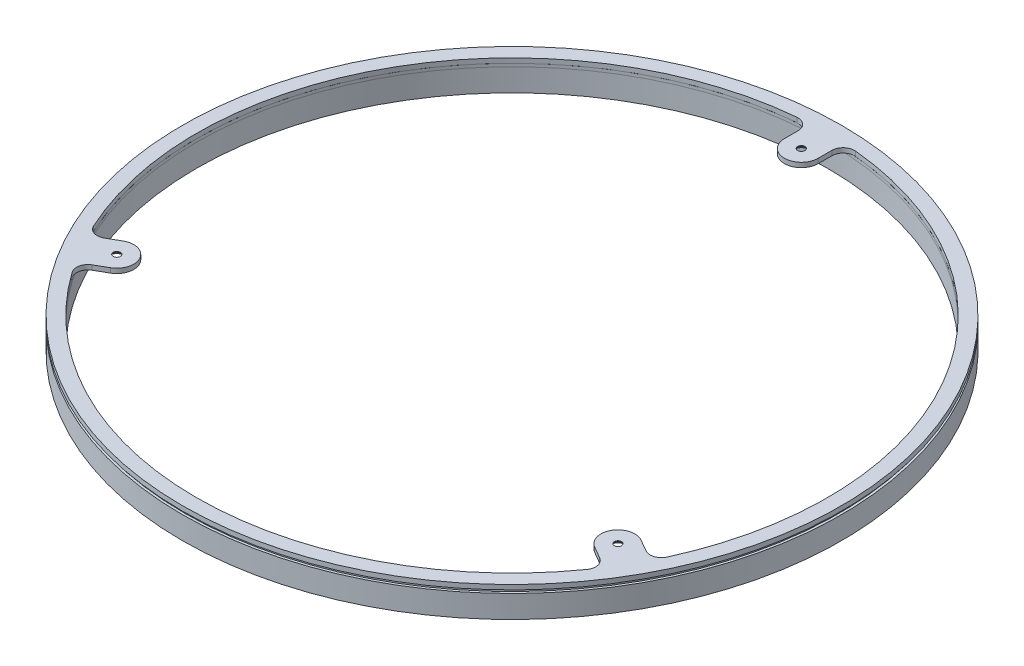
ISO-10303-21;
HEADER;
FILE_DESCRIPTION(('STEP AP214'),'2;1');
FILE_NAME('part.step','',(''),(''),'','','');
FILE_SCHEMA(('AUTOMOTIVE_DESIGN { 1 0 10303 214 1 1 1 1 }'));
ENDSEC;
DATA;
#1=APPLICATION_CONTEXT('core data for automotive mechanical design processes');
#2=APPLICATION_PROTOCOL_DEFINITION('international standard','automotive_design',2000,#1);
#3=PRODUCT_CONTEXT('',#1,'mechanical');
#4=PRODUCT('Part','Part','',(#3));
#5=PRODUCT_RELATED_PRODUCT_CATEGORY('part','',(#4));
#6=PRODUCT_DEFINITION_FORMATION('','',#4);
#7=PRODUCT_DEFINITION_CONTEXT('part definition',#1,'design');
#8=PRODUCT_DEFINITION('design','',#6,#7);
#9=PRODUCT_DEFINITION_SHAPE('','',#8);
#10=(LENGTH_UNIT() NAMED_UNIT(*) SI_UNIT(.MILLI.,.METRE.));
#11=(NAMED_UNIT(*) PLANE_ANGLE_UNIT() SI_UNIT($,.RADIAN.));
#12=(NAMED_UNIT(*) SI_UNIT($,.STERADIAN.) SOLID_ANGLE_UNIT());
#13=UNCERTAINTY_MEASURE_WITH_UNIT(LENGTH_MEASURE(1.E-05),#10,'distance_accuracy_value','');
#14=(GEOMETRIC_REPRESENTATION_CONTEXT(3) GLOBAL_UNCERTAINTY_ASSIGNED_CONTEXT((#13)) GLOBAL_UNIT_ASSIGNED_CONTEXT((#10,
#11,#12)) REPRESENTATION_CONTEXT('',''));
#15=CARTESIAN_POINT('',(0.,0.,0.));
#16=DIRECTION('',(0.,0.,1.));
#17=DIRECTION('',(1.,0.,0.));
#18=AXIS2_PLACEMENT_3D('',#15,#16,#17);
#19=CARTESIAN_POINT('',(0.,-11.34313,0.));
#20=DIRECTION('',(0.,-1.,0.));
#21=DIRECTION('',(0.,0.,-1.));
#22=AXIS2_PLACEMENT_3D('',#19,#20,#21);
#23=PLANE('',#22);
#24=CARTESIAN_POINT('',(0.,-11.34313,0.));
#25=DIRECTION('',(0.,-1.,0.));
#26=DIRECTION('',(0.,0.,-1.));
#27=AXIS2_PLACEMENT_3D('',#24,#25,#26);
#28=CIRCLE('',#27,145.88);
#29=CARTESIAN_POINT('',(0.,-11.34313,-145.88));
#30=VERTEX_POINT('',#29);
#31=EDGE_CURVE('E11',#30,#30,#28,.T.);
#32=ORIENTED_EDGE('',*,*,#31,.T.);
#33=EDGE_LOOP('',(#32));
#34=FACE_BOUND('',#33,.T.);
#35=CARTESIAN_POINT('',(0.,-11.34313,0.));
#36=DIRECTION('',(0.,-1.,0.));
#37=DIRECTION('',(0.,0.,-1.));
#38=AXIS2_PLACEMENT_3D('',#35,#36,#37);
#39=CIRCLE('',#38,139.67);
#40=CARTESIAN_POINT('',(0.,-11.34313,-139.67));
#41=VERTEX_POINT('',#40);
#42=EDGE_CURVE('E67',#41,#41,#39,.T.);
#43=ORIENTED_EDGE('',*,*,#42,.F.);
#44=EDGE_LOOP('',(#43));
#45=FACE_BOUND('',#44,.T.);
#46=ADVANCED_FACE('F54',(#34,#45),#23,.T.);
#47=CARTESIAN_POINT('',(0.,-1.34313,0.));
#48=DIRECTION('',(0.,-1.,0.));
#49=DIRECTION('',(0.,0.,-1.));
#50=AXIS2_PLACEMENT_3D('',#47,#48,#49);
#51=PLANE('',#50);
#52=CARTESIAN_POINT('',(0.,-1.34313,0.));
#53=DIRECTION('',(0.,-1.,0.));
#54=DIRECTION('',(0.,0.,-1.));
#55=AXIS2_PLACEMENT_3D('',#52,#53,#54);
#56=CIRCLE('',#55,145.88);
#57=CARTESIAN_POINT('',(0.,-1.34313,-145.88));
#58=VERTEX_POINT('',#57);
#59=EDGE_CURVE('E58',#58,#58,#56,.T.);
#60=ORIENTED_EDGE('',*,*,#59,.F.);
#61=EDGE_LOOP('',(#60));
#62=FACE_BOUND('',#61,.T.);
#63=CARTESIAN_POINT('',(0.,-1.34313,0.));
#64=DIRECTION('',(0.,-1.,0.));
#65=DIRECTION('',(0.,0.,-1.));
#66=AXIS2_PLACEMENT_3D('',#63,#64,#65);
#67=CIRCLE('',#66,139.67);
#68=CARTESIAN_POINT('',(0.,-1.34313,-139.67));
#69=VERTEX_POINT('',#68);
#70=EDGE_CURVE('E69',#69,#69,#67,.T.);
#71=ORIENTED_EDGE('',*,*,#70,.T.);
#72=EDGE_LOOP('',(#71));
#73=FACE_BOUND('',#72,.T.);
#74=ADVANCED_FACE('F81',(#62,#73),#51,.F.);
#75=CARTESIAN_POINT('',(0.,-11.34313,0.));
#76=DIRECTION('',(0.,1.,0.));
#77=DIRECTION('',(0.,0.,1.));
#78=AXIS2_PLACEMENT_3D('',#75,#76,#77);
#79=CYLINDRICAL_SURFACE('',#78,145.88);
#80=ORIENTED_EDGE('',*,*,#31,.F.);
#81=EDGE_LOOP('',(#80));
#82=FACE_BOUND('',#81,.T.);
#83=ORIENTED_EDGE('',*,*,#59,.T.);
#84=EDGE_LOOP('',(#83));
#85=FACE_BOUND('',#84,.T.);
#86=ADVANCED_FACE('F56',(#82,#85),#79,.T.);
#87=CARTESIAN_POINT('',(0.,-11.34313,0.));
#88=DIRECTION('',(0.,1.,0.));
#89=DIRECTION('',(0.,0.,1.));
#90=AXIS2_PLACEMENT_3D('',#87,#88,#89);
#91=CYLINDRICAL_SURFACE('',#90,139.67);
#92=ORIENTED_EDGE('',*,*,#42,.T.);
#93=EDGE_LOOP('',(#92));
#94=FACE_BOUND('',#93,.T.);
#95=ORIENTED_EDGE('',*,*,#70,.F.);
#96=EDGE_LOOP('',(#95));
#97=FACE_BOUND('',#96,.T.);
#98=ADVANCED_FACE('F77',(#94,#97),#91,.F.);
#99=CLOSED_SHELL('',(#46,#74,#86,#98));
#100=MANIFOLD_SOLID_BREP('B2',#99);
#101=CARTESIAN_POINT('',(0.,-1.34313,0.));
#102=DIRECTION('',(0.,-1.,0.));
#103=DIRECTION('',(0.,0.,-1.));
#104=AXIS2_PLACEMENT_3D('',#101,#102,#103);
#105=PLANE('',#104);
#106=CARTESIAN_POINT('',(0.,-1.34313,0.));
#107=DIRECTION('',(0.,-1.,0.));
#108=DIRECTION('',(0.,0.,-1.));
#109=AXIS2_PLACEMENT_3D('',#106,#107,#108);
#110=CIRCLE('',#109,144.84);
#111=CARTESIAN_POINT('',(0.,-1.34313,-144.84));
#112=VERTEX_POINT('',#111);
#113=EDGE_CURVE('E53',#112,#112,#110,.T.);
#114=ORIENTED_EDGE('',*,*,#113,.T.);
#115=EDGE_LOOP('',(#114));
#116=FACE_BOUND('',#115,.T.);
#117=CARTESIAN_POINT('',(0.,-1.34313,0.));
#118=DIRECTION('',(0.,-1.,0.));
#119=DIRECTION('',(0.,0.,-1.));
#120=AXIS2_PLACEMENT_3D('',#117,#118,#119);
#121=CIRCLE('',#120,139.67);
#122=CARTESIAN_POINT('',(0.,-1.34313,-139.67));
#123=VERTEX_POINT('',#122);
#124=EDGE_CURVE('E148',#123,#123,#121,.T.);
#125=ORIENTED_EDGE('',*,*,#124,.F.);
#126=EDGE_LOOP('',(#125));
#127=FACE_BOUND('',#126,.T.);
#128=ADVANCED_FACE('F137',(#116,#127),#105,.T.);
#129=CARTESIAN_POINT('',(0.,0.,0.));
#130=DIRECTION('',(0.,-1.,0.));
#131=DIRECTION('',(0.,0.,-1.));
#132=AXIS2_PLACEMENT_3D('',#129,#130,#131);
#133=PLANE('',#132);
#134=CARTESIAN_POINT('',(0.,0.,0.));
#135=DIRECTION('',(0.,-1.,0.));
#136=DIRECTION('',(0.,0.,-1.));
#137=AXIS2_PLACEMENT_3D('',#134,#135,#136);
#138=CIRCLE('',#137,144.84);
#139=CARTESIAN_POINT('',(0.,0.,-144.84));
#140=VERTEX_POINT('',#139);
#141=EDGE_CURVE('E141',#140,#140,#138,.T.);
#142=ORIENTED_EDGE('',*,*,#141,.F.);
#143=EDGE_LOOP('',(#142));
#144=FACE_BOUND('',#143,.T.);
#145=CARTESIAN_POINT('',(0.,0.,0.));
#146=DIRECTION('',(0.,-1.,0.));
#147=DIRECTION('',(0.,0.,-1.));
#148=AXIS2_PLACEMENT_3D('',#145,#146,#147);
#149=CIRCLE('',#148,139.67);
#150=CARTESIAN_POINT('',(0.,0.,-139.67));
#151=VERTEX_POINT('',#150);
#152=EDGE_CURVE('E150',#151,#151,#149,.T.);
#153=ORIENTED_EDGE('',*,*,#152,.T.);
#154=EDGE_LOOP('',(#153));
#155=FACE_BOUND('',#154,.T.);
#156=ADVANCED_FACE('F160',(#144,#155),#133,.F.);
#157=CARTESIAN_POINT('',(0.,-1.34313,0.));
#158=DIRECTION('',(0.,1.,0.));
#159=DIRECTION('',(0.,0.,1.));
#160=AXIS2_PLACEMENT_3D('',#157,#158,#159);
#161=CYLINDRICAL_SURFACE('',#160,144.84);
#162=ORIENTED_EDGE('',*,*,#113,.F.);
#163=EDGE_LOOP('',(#162));
#164=FACE_BOUND('',#163,.T.);
#165=ORIENTED_EDGE('',*,*,#141,.T.);
#166=EDGE_LOOP('',(#165));
#167=FACE_BOUND('',#166,.T.);
#168=ADVANCED_FACE('F139',(#164,#167),#161,.T.);
#169=CARTESIAN_POINT('',(0.,-1.34313,0.));
#170=DIRECTION('',(0.,1.,0.));
#171=DIRECTION('',(0.,0.,1.));
#172=AXIS2_PLACEMENT_3D('',#169,#170,#171);
#173=CYLINDRICAL_SURFACE('',#172,139.67);
#174=ORIENTED_EDGE('',*,*,#124,.T.);
#175=EDGE_LOOP('',(#174));
#176=FACE_BOUND('',#175,.T.);
#177=ORIENTED_EDGE('',*,*,#152,.F.);
#178=EDGE_LOOP('',(#177));
#179=FACE_BOUND('',#178,.T.);
#180=ADVANCED_FACE('F156',(#176,#179),#173,.F.);
#181=CLOSED_SHELL('',(#128,#156,#168,#180));
#182=MANIFOLD_SOLID_BREP('B6',#181);
#183=CARTESIAN_POINT('',(0.,2.07456,0.));
#184=DIRECTION('',(0.,1.,0.));
#185=DIRECTION('',(0.,0.,1.));
#186=AXIS2_PLACEMENT_3D('',#183,#184,#185);
#187=PLANE('',#186);
#188=CARTESIAN_POINT('',(0.,2.07456,0.));
#189=DIRECTION('',(0.,1.,0.));
#190=DIRECTION('',(0.,0.,1.));
#191=AXIS2_PLACEMENT_3D('',#188,#189,#190);
#192=CIRCLE('',#191,139.67);
#193=CARTESIAN_POINT('',(-12.9640974233311,2.07456,-139.067038071566));
#194=VERTEX_POINT('',#193);
#195=CARTESIAN_POINT('',(-126.917636510699,2.07456,58.3062813300425));
#196=VERTEX_POINT('',#195);
#197=EDGE_CURVE('E416',#194,#196,#192,.T.);
#198=ORIENTED_EDGE('',*,*,#197,.F.);
#199=CARTESIAN_POINT('',(-12.5,2.07456,-134.088623305633));
#200=DIRECTION('',(0.,1.,0.));
#201=DIRECTION('',(0.,0.,1.));
#202=AXIS2_PLACEMENT_3D('',#199,#200,#201);
#203=CIRCLE('',#202,5.);
#204=CARTESIAN_POINT('',(-7.5,2.07456,-134.088623305633));
#205=VERTEX_POINT('',#204);
#206=EDGE_CURVE('E448',#194,#205,#203,.F.);
#207=ORIENTED_EDGE('',*,*,#206,.T.);
#208=DIRECTION('',(0.,0.,1.));
#209=VECTOR('',#208,1.);
#210=CARTESIAN_POINT('',(-7.5,2.07456,-128.0625));
#211=LINE('',#210,#209);
#212=CARTESIAN_POINT('',(-7.5,2.07456,-128.0625));
#213=VERTEX_POINT('',#212);
#214=EDGE_CURVE('E397',#205,#213,#211,.T.);
#215=ORIENTED_EDGE('',*,*,#214,.T.);
#216=CARTESIAN_POINT('',(0.,2.07456,-128.0625));
#217=DIRECTION('',(0.,1.,0.));
#218=DIRECTION('',(0.,0.,1.));
#219=AXIS2_PLACEMENT_3D('',#216,#217,#218);
#220=CIRCLE('',#219,7.5);
#221=CARTESIAN_POINT('',(7.5,2.07456,-128.0625));
#222=VERTEX_POINT('',#221);
#223=EDGE_CURVE('E409',#213,#222,#220,.T.);
#224=ORIENTED_EDGE('',*,*,#223,.T.);
#225=DIRECTION('',(0.,0.,-1.));
#226=VECTOR('',#225,1.);
#227=CARTESIAN_POINT('',(7.5,2.07456,-128.0625));
#228=LINE('',#227,#226);
#229=CARTESIAN_POINT('',(7.5,2.07456,-134.088623305633));
#230=VERTEX_POINT('',#229);
#231=EDGE_CURVE('E405',#222,#230,#228,.T.);
#232=ORIENTED_EDGE('',*,*,#231,.T.);
#233=CARTESIAN_POINT('',(12.5,2.07456,-134.088623305633));
#234=DIRECTION('',(0.,1.,0.));
#235=DIRECTION('',(0.,0.,1.));
#236=AXIS2_PLACEMENT_3D('',#233,#234,#235);
#237=CIRCLE('',#236,5.);
#238=CARTESIAN_POINT('',(12.9640974233311,2.07456,-139.067038071566));
#239=VERTEX_POINT('',#238);
#240=EDGE_CURVE('E443',#230,#239,#237,.F.);
#241=ORIENTED_EDGE('',*,*,#240,.T.);
#242=CARTESIAN_POINT('',(126.9176365107,2.07456,58.3062813300407));
#243=VERTEX_POINT('',#242);
#244=EDGE_CURVE('E421',#243,#239,#192,.T.);
#245=ORIENTED_EDGE('',*,*,#244,.F.);
#246=CARTESIAN_POINT('',(122.374154141161,2.07456,56.21899410551));
#247=DIRECTION('',(0.,1.,0.));
#248=DIRECTION('',(0.,0.,1.));
#249=AXIS2_PLACEMENT_3D('',#246,#247,#248);
#250=CIRCLE('',#249,5.);
#251=CARTESIAN_POINT('',(119.874154141161,2.07456,60.5491211244322));
#252=VERTEX_POINT('',#251);
#253=EDGE_CURVE('E135',#243,#252,#250,.F.);
#254=ORIENTED_EDGE('',*,*,#253,.T.);
#255=DIRECTION('',(-0.866025403784443,0.,-0.499999999999992));
#256=VECTOR('',#255,1.);
#257=CARTESIAN_POINT('',(114.655378272145,2.07456,57.5360594716156));
#258=LINE('',#257,#256);
#259=CARTESIAN_POINT('',(114.655378272145,2.07456,57.5360594716156));
#260=VERTEX_POINT('',#259);
#261=EDGE_CURVE('E355',#252,#260,#258,.T.);
#262=ORIENTED_EDGE('',*,*,#261,.T.);
#263=CARTESIAN_POINT('',(110.905378272145,2.07456,64.031249999999));
#264=DIRECTION('',(0.,1.,0.));
#265=DIRECTION('',(0.,0.,1.));
#266=AXIS2_PLACEMENT_3D('',#263,#264,#265);
#267=CIRCLE('',#266,7.5);
#268=CARTESIAN_POINT('',(107.155378272145,2.07456000000001,70.5264405283823));
#269=VERTEX_POINT('',#268);
#270=EDGE_CURVE('E341',#260,#269,#267,.T.);
#271=ORIENTED_EDGE('',*,*,#270,.T.);
#272=DIRECTION('',(0.866025403784443,0.,0.499999999999992));
#273=VECTOR('',#272,1.);
#274=CARTESIAN_POINT('',(107.155378272145,2.07456,70.5264405283823));
#275=LINE('',#274,#273);
#276=CARTESIAN_POINT('',(112.374154141161,2.07456,73.5395021811988));
#277=VERTEX_POINT('',#276);
#278=EDGE_CURVE('E329',#269,#277,#275,.T.);
#279=ORIENTED_EDGE('',*,*,#278,.T.);
#280=CARTESIAN_POINT('',(109.874154141161,2.07456,77.8696292001211));
#281=DIRECTION('',(0.,1.,0.));
#282=DIRECTION('',(0.,0.,1.));
#283=AXIS2_PLACEMENT_3D('',#280,#281,#282);
#284=CIRCLE('',#283,5.);
#285=CARTESIAN_POINT('',(113.953539087369,2.07456,80.7607567415231));
#286=VERTEX_POINT('',#285);
#287=EDGE_CURVE('E478',#277,#286,#284,.F.);
#288=ORIENTED_EDGE('',*,*,#287,.T.);
#289=CARTESIAN_POINT('',(-113.953539087368,2.07456,80.7607567415246));
#290=VERTEX_POINT('',#289);
#291=EDGE_CURVE('E420',#290,#286,#192,.T.);
#292=ORIENTED_EDGE('',*,*,#291,.F.);
#293=CARTESIAN_POINT('',(-109.87415414116,2.07456,77.8696292001226));
#294=DIRECTION('',(0.,1.,0.));
#295=DIRECTION('',(0.,0.,1.));
#296=AXIS2_PLACEMENT_3D('',#293,#294,#295);
#297=CIRCLE('',#296,5.);
#298=CARTESIAN_POINT('',(-112.37415414116,2.07456,73.5395021812004));
#299=VERTEX_POINT('',#298);
#300=EDGE_CURVE('E466',#290,#299,#297,.F.);
#301=ORIENTED_EDGE('',*,*,#300,.T.);
#302=DIRECTION('',(0.866025403784436,0.,-0.500000000000004));
#303=VECTOR('',#302,1.);
#304=CARTESIAN_POINT('',(-107.155378272144,2.07456,70.5264405283838));
#305=LINE('',#304,#303);
#306=CARTESIAN_POINT('',(-107.155378272144,2.07456,70.5264405283838));
#307=VERTEX_POINT('',#306);
#308=EDGE_CURVE('E367',#299,#307,#305,.T.);
#309=ORIENTED_EDGE('',*,*,#308,.T.);
#310=CARTESIAN_POINT('',(-110.905378272144,2.07456,64.0312500000005));
#311=DIRECTION('',(0.,1.,0.));
#312=DIRECTION('',(0.,0.,1.));
#313=AXIS2_PLACEMENT_3D('',#310,#311,#312);
#314=CIRCLE('',#313,7.5);
#315=CARTESIAN_POINT('',(-114.655378272144,2.07456,57.5360594716172));
#316=VERTEX_POINT('',#315);
#317=EDGE_CURVE('E379',#307,#316,#314,.T.);
#318=ORIENTED_EDGE('',*,*,#317,.T.);
#319=DIRECTION('',(-0.866025403784436,0.,0.500000000000004));
#320=VECTOR('',#319,1.);
#321=CARTESIAN_POINT('',(-114.655378272144,2.07456,57.5360594716172));
#322=LINE('',#321,#320);
#323=CARTESIAN_POINT('',(-119.87415414116,2.07456,60.5491211244339));
#324=VERTEX_POINT('',#323);
#325=EDGE_CURVE('E375',#316,#324,#322,.T.);
#326=ORIENTED_EDGE('',*,*,#325,.T.);
#327=CARTESIAN_POINT('',(-122.37415414116,2.07456,56.2189941055117));
#328=DIRECTION('',(0.,1.,0.));
#329=DIRECTION('',(0.,0.,1.));
#330=AXIS2_PLACEMENT_3D('',#327,#328,#329);
#331=CIRCLE('',#330,5.);
#332=EDGE_CURVE('E462',#324,#196,#331,.F.);
#333=ORIENTED_EDGE('',*,*,#332,.T.);
#334=EDGE_LOOP('',(#198,#207,#215,#224,#232,#241,#245,#254,#262,#271,#279,#288,#292,#301,#309,
#318,#326,#333));
#335=FACE_BOUND('',#334,.T.);
#336=CARTESIAN_POINT('',(0.,2.07456,0.));
#337=DIRECTION('',(0.,1.,0.));
#338=DIRECTION('',(0.,0.,1.));
#339=AXIS2_PLACEMENT_3D('',#336,#337,#338);
#340=CIRCLE('',#339,145.86);
#341=CARTESIAN_POINT('',(0.,2.07456,145.86));
#342=VERTEX_POINT('',#341);
#343=EDGE_CURVE('E426',#342,#342,#340,.T.);
#344=ORIENTED_EDGE('',*,*,#343,.T.);
#345=EDGE_LOOP('',(#344));
#346=FACE_BOUND('',#345,.T.);
#347=CARTESIAN_POINT('',(0.,2.07456,-128.0625));
#348=DIRECTION('',(0.,-1.,0.));
#349=DIRECTION('',(0.,0.,-1.));
#350=AXIS2_PLACEMENT_3D('',#347,#348,#349);
#351=CIRCLE('',#350,1.6);
#352=CARTESIAN_POINT('',(0.,2.07456,-129.6625));
#353=VERTEX_POINT('',#352);
#354=EDGE_CURVE('E391',#353,#353,#351,.T.);
#355=ORIENTED_EDGE('',*,*,#354,.T.);
#356=EDGE_LOOP('',(#355));
#357=FACE_BOUND('',#356,.T.);
#358=CARTESIAN_POINT('',(-110.905378272144,2.07456,64.0312500000005));
#359=DIRECTION('',(0.,-1.,0.));
#360=DIRECTION('',(0.,0.,-1.));
#361=AXIS2_PLACEMENT_3D('',#358,#359,#360);
#362=CIRCLE('',#361,1.6);
#363=CARTESIAN_POINT('',(-110.905378272144,2.07456,62.4312500000005));
#364=VERTEX_POINT('',#363);
#365=EDGE_CURVE('E364',#364,#364,#362,.T.);
#366=ORIENTED_EDGE('',*,*,#365,.T.);
#367=EDGE_LOOP('',(#366));
#368=FACE_BOUND('',#367,.T.);
#369=CARTESIAN_POINT('',(110.905378272145,2.07456,64.031249999999));
#370=DIRECTION('',(0.,-1.,0.));
#371=DIRECTION('',(0.,0.,-1.));
#372=AXIS2_PLACEMENT_3D('',#369,#370,#371);
#373=CIRCLE('',#372,1.6);
#374=CARTESIAN_POINT('',(110.905378272145,2.07456,62.431249999999));
#375=VERTEX_POINT('',#374);
#376=EDGE_CURVE('E504',#375,#375,#373,.T.);
#377=ORIENTED_EDGE('',*,*,#376,.T.);
#378=EDGE_LOOP('',(#377));
#379=FACE_BOUND('',#378,.T.);
#380=ADVANCED_FACE('F207',(#335,#346,#357,#368,#379),#187,.T.);
#381=CARTESIAN_POINT('',(0.,0.,0.));
#382=DIRECTION('',(0.,1.,0.));
#383=DIRECTION('',(0.,0.,1.));
#384=AXIS2_PLACEMENT_3D('',#381,#382,#383);
#385=PLANE('',#384);
#386=CARTESIAN_POINT('',(110.905378272145,0.,64.031249999999));
#387=DIRECTION('',(0.,-1.,0.));
#388=DIRECTION('',(0.,0.,-1.));
#389=AXIS2_PLACEMENT_3D('',#386,#387,#388);
#390=CIRCLE('',#389,3.35000000000001);
#391=CARTESIAN_POINT('',(110.905378272145,0.,60.681249999999));
#392=VERTEX_POINT('',#391);
#393=EDGE_CURVE('E510',#392,#392,#390,.T.);
#394=ORIENTED_EDGE('',*,*,#393,.F.);
#395=EDGE_LOOP('',(#394));
#396=FACE_BOUND('',#395,.T.);
#397=CARTESIAN_POINT('',(0.,0.,-128.0625));
#398=DIRECTION('',(0.,-1.,0.));
#399=DIRECTION('',(0.,0.,-1.));
#400=AXIS2_PLACEMENT_3D('',#397,#398,#399);
#401=CIRCLE('',#400,3.35);
#402=CARTESIAN_POINT('',(0.,0.,-131.4125));
#403=VERTEX_POINT('',#402);
#404=EDGE_CURVE('E378',#403,#403,#401,.T.);
#405=ORIENTED_EDGE('',*,*,#404,.F.);
#406=EDGE_LOOP('',(#405));
#407=FACE_BOUND('',#406,.T.);
#408=CARTESIAN_POINT('',(0.,0.,0.));
#409=DIRECTION('',(0.,1.,0.));
#410=DIRECTION('',(0.,0.,1.));
#411=AXIS2_PLACEMENT_3D('',#408,#409,#410);
#412=CIRCLE('',#411,145.86);
#413=CARTESIAN_POINT('',(0.,0.,145.86));
#414=VERTEX_POINT('',#413);
#415=EDGE_CURVE('E419',#414,#414,#412,.T.);
#416=ORIENTED_EDGE('',*,*,#415,.F.);
#417=EDGE_LOOP('',(#416));
#418=FACE_BOUND('',#417,.T.);
#419=DIRECTION('',(0.,0.,1.));
#420=VECTOR('',#419,1.);
#421=CARTESIAN_POINT('',(-7.5,0.,-128.0625));
#422=LINE('',#421,#420);
#423=CARTESIAN_POINT('',(-7.5,0.,-134.088623305633));
#424=VERTEX_POINT('',#423);
#425=CARTESIAN_POINT('',(-7.5,0.,-128.0625));
#426=VERTEX_POINT('',#425);
#427=EDGE_CURVE('E395',#424,#426,#422,.T.);
#428=ORIENTED_EDGE('',*,*,#427,.F.);
#429=CARTESIAN_POINT('',(-12.5,0.,-134.088623305633));
#430=DIRECTION('',(0.,1.,0.));
#431=DIRECTION('',(0.,0.,1.));
#432=AXIS2_PLACEMENT_3D('',#429,#430,#431);
#433=CIRCLE('',#432,5.);
#434=CARTESIAN_POINT('',(-12.9640974233311,0.,-139.067038071566));
#435=VERTEX_POINT('',#434);
#436=EDGE_CURVE('E446',#424,#435,#433,.T.);
#437=ORIENTED_EDGE('',*,*,#436,.T.);
#438=CARTESIAN_POINT('',(0.,0.,0.));
#439=DIRECTION('',(0.,1.,0.));
#440=DIRECTION('',(0.,0.,1.));
#441=AXIS2_PLACEMENT_3D('',#438,#439,#440);
#442=CIRCLE('',#441,139.67);
#443=CARTESIAN_POINT('',(-126.917636510699,0.,58.3062813300425));
#444=VERTEX_POINT('',#443);
#445=EDGE_CURVE('E422',#435,#444,#442,.T.);
#446=ORIENTED_EDGE('',*,*,#445,.T.);
#447=CARTESIAN_POINT('',(-122.37415414116,0.,56.2189941055117));
#448=DIRECTION('',(0.,1.,0.));
#449=DIRECTION('',(0.,0.,1.));
#450=AXIS2_PLACEMENT_3D('',#447,#448,#449);
#451=CIRCLE('',#450,5.);
#452=CARTESIAN_POINT('',(-119.87415414116,0.,60.5491211244339));
#453=VERTEX_POINT('',#452);
#454=EDGE_CURVE('E460',#444,#453,#451,.T.);
#455=ORIENTED_EDGE('',*,*,#454,.T.);
#456=DIRECTION('',(-0.866025403784436,0.,0.500000000000004));
#457=VECTOR('',#456,1.);
#458=CARTESIAN_POINT('',(-114.655378272144,0.,57.5360594716172));
#459=LINE('',#458,#457);
#460=CARTESIAN_POINT('',(-114.655378272144,0.,57.5360594716172));
#461=VERTEX_POINT('',#460);
#462=EDGE_CURVE('E368',#461,#453,#459,.T.);
#463=ORIENTED_EDGE('',*,*,#462,.F.);
#464=CARTESIAN_POINT('',(-110.905378272144,0.,64.0312500000005));
#465=DIRECTION('',(0.,1.,0.));
#466=DIRECTION('',(0.866025403784436,0.,-0.500000000000004));
#467=AXIS2_PLACEMENT_3D('',#464,#465,#466);
#468=CIRCLE('',#467,7.5);
#469=CARTESIAN_POINT('',(-107.155378272144,0.,70.5264405283838));
#470=VERTEX_POINT('',#469);
#471=EDGE_CURVE('E372',#470,#461,#468,.T.);
#472=ORIENTED_EDGE('',*,*,#471,.F.);
#473=DIRECTION('',(0.866025403784437,0.,-0.500000000000004));
#474=VECTOR('',#473,1.);
#475=CARTESIAN_POINT('',(-107.155378272144,0.,70.5264405283838));
#476=LINE('',#475,#474);
#477=CARTESIAN_POINT('',(-112.37415414116,0.,73.5395021812004));
#478=VERTEX_POINT('',#477);
#479=EDGE_CURVE('E365',#478,#470,#476,.T.);
#480=ORIENTED_EDGE('',*,*,#479,.F.);
#481=CARTESIAN_POINT('',(-109.87415414116,0.,77.8696292001226));
#482=DIRECTION('',(0.,1.,0.));
#483=DIRECTION('',(0.,0.,1.));
#484=AXIS2_PLACEMENT_3D('',#481,#482,#483);
#485=CIRCLE('',#484,5.);
#486=CARTESIAN_POINT('',(-113.953539087368,0.,80.7607567415246));
#487=VERTEX_POINT('',#486);
#488=EDGE_CURVE('E464',#478,#487,#485,.T.);
#489=ORIENTED_EDGE('',*,*,#488,.T.);
#490=CARTESIAN_POINT('',(113.953539087369,0.,80.7607567415231));
#491=VERTEX_POINT('',#490);
#492=EDGE_CURVE('E425',#487,#491,#442,.T.);
#493=ORIENTED_EDGE('',*,*,#492,.T.);
#494=CARTESIAN_POINT('',(109.874154141161,0.,77.8696292001211));
#495=DIRECTION('',(0.,1.,0.));
#496=DIRECTION('',(0.,0.,1.));
#497=AXIS2_PLACEMENT_3D('',#494,#495,#496);
#498=CIRCLE('',#497,5.);
#499=CARTESIAN_POINT('',(112.374154141161,0.,73.5395021811988));
#500=VERTEX_POINT('',#499);
#501=EDGE_CURVE('E476',#491,#500,#498,.T.);
#502=ORIENTED_EDGE('',*,*,#501,.T.);
#503=DIRECTION('',(0.866025403784443,0.,0.499999999999992));
#504=VECTOR('',#503,1.);
#505=CARTESIAN_POINT('',(107.155378272145,0.,70.5264405283823));
#506=LINE('',#505,#504);
#507=CARTESIAN_POINT('',(107.155378272145,0.,70.5264405283823));
#508=VERTEX_POINT('',#507);
#509=EDGE_CURVE('E350',#508,#500,#506,.T.);
#510=ORIENTED_EDGE('',*,*,#509,.F.);
#511=CARTESIAN_POINT('',(110.905378272145,0.,64.031249999999));
#512=DIRECTION('',(0.,1.,0.));
#513=DIRECTION('',(-0.866025403784443,0.,-0.499999999999992));
#514=AXIS2_PLACEMENT_3D('',#511,#512,#513);
#515=CIRCLE('',#514,7.5);
#516=CARTESIAN_POINT('',(114.655378272145,0.,57.5360594716156));
#517=VERTEX_POINT('',#516);
#518=EDGE_CURVE('E349',#517,#508,#515,.T.);
#519=ORIENTED_EDGE('',*,*,#518,.F.);
#520=DIRECTION('',(-0.866025403784443,0.,-0.499999999999992));
#521=VECTOR('',#520,1.);
#522=CARTESIAN_POINT('',(114.655378272145,0.,57.5360594716156));
#523=LINE('',#522,#521);
#524=CARTESIAN_POINT('',(119.874154141161,0.,60.5491211244322));
#525=VERTEX_POINT('',#524);
#526=EDGE_CURVE('E358',#525,#517,#523,.T.);
#527=ORIENTED_EDGE('',*,*,#526,.F.);
#528=CARTESIAN_POINT('',(122.374154141161,0.,56.21899410551));
#529=DIRECTION('',(0.,1.,0.));
#530=DIRECTION('',(0.,0.,1.));
#531=AXIS2_PLACEMENT_3D('',#528,#529,#530);
#532=CIRCLE('',#531,5.);
#533=CARTESIAN_POINT('',(126.9176365107,0.,58.3062813300407));
#534=VERTEX_POINT('',#533);
#535=EDGE_CURVE('E215',#525,#534,#532,.T.);
#536=ORIENTED_EDGE('',*,*,#535,.T.);
#537=CARTESIAN_POINT('',(12.9640974233311,0.,-139.067038071566));
#538=VERTEX_POINT('',#537);
#539=EDGE_CURVE('E408',#534,#538,#442,.T.);
#540=ORIENTED_EDGE('',*,*,#539,.T.);
#541=CARTESIAN_POINT('',(12.5,0.,-134.088623305633));
#542=DIRECTION('',(0.,1.,0.));
#543=DIRECTION('',(0.,0.,1.));
#544=AXIS2_PLACEMENT_3D('',#541,#542,#543);
#545=CIRCLE('',#544,5.);
#546=CARTESIAN_POINT('',(7.5,0.,-134.088623305633));
#547=VERTEX_POINT('',#546);
#548=EDGE_CURVE('E441',#538,#547,#545,.T.);
#549=ORIENTED_EDGE('',*,*,#548,.T.);
#550=DIRECTION('',(0.,0.,-1.));
#551=VECTOR('',#550,1.);
#552=CARTESIAN_POINT('',(7.5,0.,-128.0625));
#553=LINE('',#552,#551);
#554=CARTESIAN_POINT('',(7.5,0.,-128.0625));
#555=VERTEX_POINT('',#554);
#556=EDGE_CURVE('E398',#555,#547,#553,.T.);
#557=ORIENTED_EDGE('',*,*,#556,.F.);
#558=CARTESIAN_POINT('',(0.,0.,-128.0625));
#559=DIRECTION('',(0.,1.,0.));
#560=DIRECTION('',(0.,0.,1.));
#561=AXIS2_PLACEMENT_3D('',#558,#559,#560);
#562=CIRCLE('',#561,7.5);
#563=EDGE_CURVE('E402',#426,#555,#562,.T.);
#564=ORIENTED_EDGE('',*,*,#563,.F.);
#565=EDGE_LOOP('',(#428,#437,#446,#455,#463,#472,#480,#489,#493,#502,#510,#519,#527,#536,#540,
#549,#557,#564));
#566=FACE_BOUND('',#565,.T.);
#567=CARTESIAN_POINT('',(-110.905378272144,0.,64.0312500000005));
#568=DIRECTION('',(0.,-1.,0.));
#569=DIRECTION('',(0.,0.,-1.));
#570=AXIS2_PLACEMENT_3D('',#567,#568,#569);
#571=CIRCLE('',#570,3.35000000000001);
#572=CARTESIAN_POINT('',(-110.905378272144,0.,60.6812500000005));
#573=VERTEX_POINT('',#572);
#574=EDGE_CURVE('E501',#573,#573,#571,.T.);
#575=ORIENTED_EDGE('',*,*,#574,.F.);
#576=EDGE_LOOP('',(#575));
#577=FACE_BOUND('',#576,.T.);
#578=ADVANCED_FACE('F491',(#396,#407,#418,#566,#577),#385,.F.);
#579=CARTESIAN_POINT('',(0.,2.07456,0.));
#580=DIRECTION('',(0.,-1.,0.));
#581=DIRECTION('',(0.,0.,-1.));
#582=AXIS2_PLACEMENT_3D('',#579,#580,#581);
#583=CYLINDRICAL_SURFACE('',#582,139.67);
#584=ORIENTED_EDGE('',*,*,#291,.T.);
#585=DIRECTION('',(0.,-1.,0.));
#586=VECTOR('',#585,1.);
#587=CARTESIAN_POINT('',(113.953539087369,2.07456,80.7607567415231));
#588=LINE('',#587,#586);
#589=EDGE_CURVE('E468',#286,#491,#588,.T.);
#590=ORIENTED_EDGE('',*,*,#589,.T.);
#591=ORIENTED_EDGE('',*,*,#492,.F.);
#592=DIRECTION('',(0.,-1.,0.));
#593=VECTOR('',#592,1.);
#594=CARTESIAN_POINT('',(-113.953539087368,2.07456,80.7607567415246));
#595=LINE('',#594,#593);
#596=EDGE_CURVE('E458',#487,#290,#595,.F.);
#597=ORIENTED_EDGE('',*,*,#596,.T.);
#598=EDGE_LOOP('',(#584,#590,#591,#597));
#599=FACE_BOUND('',#598,.T.);
#600=ADVANCED_FACE('F485',(#599),#583,.F.);
#601=ORIENTED_EDGE('',*,*,#539,.F.);
#602=DIRECTION('',(0.,-1.,0.));
#603=VECTOR('',#602,1.);
#604=CARTESIAN_POINT('',(126.9176365107,2.07456,58.3062813300407));
#605=LINE('',#604,#603);
#606=EDGE_CURVE('E222',#534,#243,#605,.F.);
#607=ORIENTED_EDGE('',*,*,#606,.T.);
#608=ORIENTED_EDGE('',*,*,#244,.T.);
#609=DIRECTION('',(0.,-1.,0.));
#610=VECTOR('',#609,1.);
#611=CARTESIAN_POINT('',(12.9640974233311,2.07456,-139.067038071566));
#612=LINE('',#611,#610);
#613=EDGE_CURVE('E433',#239,#538,#612,.T.);
#614=ORIENTED_EDGE('',*,*,#613,.T.);
#615=EDGE_LOOP('',(#601,#607,#608,#614));
#616=FACE_BOUND('',#615,.T.);
#617=ADVANCED_FACE('F536',(#616),#583,.F.);
#618=ORIENTED_EDGE('',*,*,#197,.T.);
#619=DIRECTION('',(0.,-1.,0.));
#620=VECTOR('',#619,1.);
#621=CARTESIAN_POINT('',(-126.917636510699,2.07456,58.3062813300425));
#622=LINE('',#621,#620);
#623=EDGE_CURVE('E450',#196,#444,#622,.T.);
#624=ORIENTED_EDGE('',*,*,#623,.T.);
#625=ORIENTED_EDGE('',*,*,#445,.F.);
#626=DIRECTION('',(0.,-1.,0.));
#627=VECTOR('',#626,1.);
#628=CARTESIAN_POINT('',(-12.9640974233311,2.07456,-139.067038071566));
#629=LINE('',#628,#627);
#630=EDGE_CURVE('E429',#435,#194,#629,.F.);
#631=ORIENTED_EDGE('',*,*,#630,.T.);
#632=EDGE_LOOP('',(#618,#624,#625,#631));
#633=FACE_BOUND('',#632,.T.);
#634=ADVANCED_FACE('F526',(#633),#583,.F.);
#635=CARTESIAN_POINT('',(0.,2.07456,0.));
#636=DIRECTION('',(0.,-1.,0.));
#637=DIRECTION('',(0.,0.,-1.));
#638=AXIS2_PLACEMENT_3D('',#635,#636,#637);
#639=CYLINDRICAL_SURFACE('',#638,145.86);
#640=ORIENTED_EDGE('',*,*,#343,.F.);
#641=EDGE_LOOP('',(#640));
#642=FACE_BOUND('',#641,.T.);
#643=ORIENTED_EDGE('',*,*,#415,.T.);
#644=EDGE_LOOP('',(#643));
#645=FACE_BOUND('',#644,.T.);
#646=ADVANCED_FACE('F523',(#642,#645),#639,.T.);
#647=CARTESIAN_POINT('',(0.,26.3664631006218,-128.0625));
#648=DIRECTION('',(0.,-1.,0.));
#649=DIRECTION('',(0.,0.,-1.));
#650=AXIS2_PLACEMENT_3D('',#647,#648,#649);
#651=CYLINDRICAL_SURFACE('',#650,7.5);
#652=ORIENTED_EDGE('',*,*,#223,.F.);
#653=DIRECTION('',(0.,-1.,0.));
#654=VECTOR('',#653,1.);
#655=CARTESIAN_POINT('',(-7.5,26.3664631006218,-128.0625));
#656=LINE('',#655,#654);
#657=EDGE_CURVE('E394',#213,#426,#656,.T.);
#658=ORIENTED_EDGE('',*,*,#657,.T.);
#659=ORIENTED_EDGE('',*,*,#563,.T.);
#660=DIRECTION('',(0.,-1.,0.));
#661=VECTOR('',#660,1.);
#662=CARTESIAN_POINT('',(7.5,26.3664631006218,-128.0625));
#663=LINE('',#662,#661);
#664=EDGE_CURVE('E401',#222,#555,#663,.T.);
#665=ORIENTED_EDGE('',*,*,#664,.F.);
#666=EDGE_LOOP('',(#652,#658,#659,#665));
#667=FACE_BOUND('',#666,.T.);
#668=ADVANCED_FACE('F525',(#667),#651,.T.);
#669=CARTESIAN_POINT('',(7.5,26.3664631006218,-128.0625));
#670=DIRECTION('',(-1.,0.,0.));
#671=DIRECTION('',(0.,0.,1.));
#672=AXIS2_PLACEMENT_3D('',#669,#670,#671);
#673=PLANE('',#672);
#674=ORIENTED_EDGE('',*,*,#556,.T.);
#675=DIRECTION('',(0.,-1.,0.));
#676=VECTOR('',#675,1.);
#677=CARTESIAN_POINT('',(7.5,26.3664631006218,-134.088623305633));
#678=LINE('',#677,#676);
#679=EDGE_CURVE('E436',#547,#230,#678,.F.);
#680=ORIENTED_EDGE('',*,*,#679,.T.);
#681=ORIENTED_EDGE('',*,*,#231,.F.);
#682=ORIENTED_EDGE('',*,*,#664,.T.);
#683=EDGE_LOOP('',(#674,#680,#681,#682));
#684=FACE_BOUND('',#683,.T.);
#685=ADVANCED_FACE('F533',(#684),#673,.F.);
#686=CARTESIAN_POINT('',(-7.5,26.3664631006218,-128.0625));
#687=DIRECTION('',(1.,0.,0.));
#688=DIRECTION('',(0.,0.,-1.));
#689=AXIS2_PLACEMENT_3D('',#686,#687,#688);
#690=PLANE('',#689);
#691=ORIENTED_EDGE('',*,*,#214,.F.);
#692=DIRECTION('',(0.,-1.,0.));
#693=VECTOR('',#692,1.);
#694=CARTESIAN_POINT('',(-7.5,26.3664631006218,-134.088623305633));
#695=LINE('',#694,#693);
#696=EDGE_CURVE('E438',#205,#424,#695,.T.);
#697=ORIENTED_EDGE('',*,*,#696,.T.);
#698=ORIENTED_EDGE('',*,*,#427,.T.);
#699=ORIENTED_EDGE('',*,*,#657,.F.);
#700=EDGE_LOOP('',(#691,#697,#698,#699));
#701=FACE_BOUND('',#700,.T.);
#702=ADVANCED_FACE('F548',(#701),#690,.F.);
#703=CARTESIAN_POINT('',(12.5,2.07456,-134.088623305633));
#704=DIRECTION('',(0.,-1.,0.));
#705=DIRECTION('',(0.,0.,-1.));
#706=AXIS2_PLACEMENT_3D('',#703,#704,#705);
#707=CYLINDRICAL_SURFACE('',#706,5.);
#708=ORIENTED_EDGE('',*,*,#240,.F.);
#709=ORIENTED_EDGE('',*,*,#679,.F.);
#710=ORIENTED_EDGE('',*,*,#548,.F.);
#711=ORIENTED_EDGE('',*,*,#613,.F.);
#712=EDGE_LOOP('',(#708,#709,#710,#711));
#713=FACE_BOUND('',#712,.T.);
#714=ADVANCED_FACE('F552',(#713),#707,.F.);
#715=CARTESIAN_POINT('',(-12.5,2.07456,-134.088623305633));
#716=DIRECTION('',(0.,-1.,0.));
#717=DIRECTION('',(0.,0.,-1.));
#718=AXIS2_PLACEMENT_3D('',#715,#716,#717);
#719=CYLINDRICAL_SURFACE('',#718,5.);
#720=ORIENTED_EDGE('',*,*,#206,.F.);
#721=ORIENTED_EDGE('',*,*,#630,.F.);
#722=ORIENTED_EDGE('',*,*,#436,.F.);
#723=ORIENTED_EDGE('',*,*,#696,.F.);
#724=EDGE_LOOP('',(#720,#721,#722,#723));
#725=FACE_BOUND('',#724,.T.);
#726=ADVANCED_FACE('F558',(#725),#719,.F.);
#727=CARTESIAN_POINT('',(0.,0.,-128.0625));
#728=DIRECTION('',(0.,-1.,0.));
#729=DIRECTION('',(0.,0.,-1.));
#730=AXIS2_PLACEMENT_3D('',#727,#728,#729);
#731=CYLINDRICAL_SURFACE('',#730,1.6);
#732=ORIENTED_EDGE('',*,*,#354,.F.);
#733=EDGE_LOOP('',(#732));
#734=FACE_BOUND('',#733,.T.);
#735=CARTESIAN_POINT('',(0.,1.75,-128.0625));
#736=DIRECTION('',(0.,-1.,0.));
#737=DIRECTION('',(0.,0.,-1.));
#738=AXIS2_PLACEMENT_3D('',#735,#736,#737);
#739=CIRCLE('',#738,1.6);
#740=CARTESIAN_POINT('',(0.,1.75,-129.6625));
#741=VERTEX_POINT('',#740);
#742=EDGE_CURVE('E388',#741,#741,#739,.T.);
#743=ORIENTED_EDGE('',*,*,#742,.T.);
#744=EDGE_LOOP('',(#743));
#745=FACE_BOUND('',#744,.T.);
#746=ADVANCED_FACE('F554',(#734,#745),#731,.F.);
#747=CARTESIAN_POINT('',(0.,0.,-128.0625));
#748=DIRECTION('',(0.,-1.,0.));
#749=DIRECTION('',(0.,0.,-1.));
#750=AXIS2_PLACEMENT_3D('',#747,#748,#749);
#751=CONICAL_SURFACE('',#750,3.35,0.785398163397449);
#752=ORIENTED_EDGE('',*,*,#742,.F.);
#753=EDGE_LOOP('',(#752));
#754=FACE_BOUND('',#753,.T.);
#755=ORIENTED_EDGE('',*,*,#404,.T.);
#756=EDGE_LOOP('',(#755));
#757=FACE_BOUND('',#756,.T.);
#758=ADVANCED_FACE('F557',(#754,#757),#751,.F.);
#759=CARTESIAN_POINT('',(-110.905378272144,30.9606386822062,64.0312500000005));
#760=DIRECTION('',(0.,-1.,0.));
#761=DIRECTION('',(0.,0.,-1.));
#762=AXIS2_PLACEMENT_3D('',#759,#760,#761);
#763=CYLINDRICAL_SURFACE('',#762,7.5);
#764=ORIENTED_EDGE('',*,*,#317,.F.);
#765=DIRECTION('',(0.,-1.,0.));
#766=VECTOR('',#765,1.);
#767=CARTESIAN_POINT('',(-107.155378272144,30.9606386822062,70.5264405283838));
#768=LINE('',#767,#766);
#769=EDGE_CURVE('E340',#307,#470,#768,.T.);
#770=ORIENTED_EDGE('',*,*,#769,.T.);
#771=ORIENTED_EDGE('',*,*,#471,.T.);
#772=DIRECTION('',(0.,-1.,0.));
#773=VECTOR('',#772,1.);
#774=CARTESIAN_POINT('',(-114.655378272144,30.9606386822062,57.5360594716172));
#775=LINE('',#774,#773);
#776=EDGE_CURVE('E371',#316,#461,#775,.T.);
#777=ORIENTED_EDGE('',*,*,#776,.F.);
#778=EDGE_LOOP('',(#764,#770,#771,#777));
#779=FACE_BOUND('',#778,.T.);
#780=ADVANCED_FACE('F562',(#779),#763,.T.);
#781=CARTESIAN_POINT('',(-114.655378272144,30.9606386822062,57.5360594716172));
#782=DIRECTION('',(0.500000000000004,0.,0.866025403784436));
#783=DIRECTION('',(0.866025403784436,0.,-0.500000000000004));
#784=AXIS2_PLACEMENT_3D('',#781,#782,#783);
#785=PLANE('',#784);
#786=ORIENTED_EDGE('',*,*,#462,.T.);
#787=DIRECTION('',(0.,-1.,0.));
#788=VECTOR('',#787,1.);
#789=CARTESIAN_POINT('',(-119.87415414116,30.9606386822062,60.5491211244339));
#790=LINE('',#789,#788);
#791=EDGE_CURVE('E453',#453,#324,#790,.F.);
#792=ORIENTED_EDGE('',*,*,#791,.T.);
#793=ORIENTED_EDGE('',*,*,#325,.F.);
#794=ORIENTED_EDGE('',*,*,#776,.T.);
#795=EDGE_LOOP('',(#786,#792,#793,#794));
#796=FACE_BOUND('',#795,.T.);
#797=ADVANCED_FACE('F566',(#796),#785,.F.);
#798=CARTESIAN_POINT('',(-107.155378272144,30.9606386822062,70.5264405283838));
#799=DIRECTION('',(-0.500000000000004,0.,-0.866025403784437));
#800=DIRECTION('',(-0.866025403784436,0.,0.500000000000004));
#801=AXIS2_PLACEMENT_3D('',#798,#799,#800);
#802=PLANE('',#801);
#803=ORIENTED_EDGE('',*,*,#308,.F.);
#804=DIRECTION('',(0.,-1.,0.));
#805=VECTOR('',#804,1.);
#806=CARTESIAN_POINT('',(-112.37415414116,30.9606386822062,73.5395021812004));
#807=LINE('',#806,#805);
#808=EDGE_CURVE('E455',#299,#478,#807,.T.);
#809=ORIENTED_EDGE('',*,*,#808,.T.);
#810=ORIENTED_EDGE('',*,*,#479,.T.);
#811=ORIENTED_EDGE('',*,*,#769,.F.);
#812=EDGE_LOOP('',(#803,#809,#810,#811));
#813=FACE_BOUND('',#812,.T.);
#814=ADVANCED_FACE('F570',(#813),#802,.F.);
#815=CARTESIAN_POINT('',(110.905378272145,30.9606386822061,64.031249999999));
#816=DIRECTION('',(0.,-1.,0.));
#817=DIRECTION('',(0.,0.,-1.));
#818=AXIS2_PLACEMENT_3D('',#815,#816,#817);
#819=CYLINDRICAL_SURFACE('',#818,7.5);
#820=ORIENTED_EDGE('',*,*,#270,.F.);
#821=DIRECTION('',(0.,-1.,0.));
#822=VECTOR('',#821,1.);
#823=CARTESIAN_POINT('',(114.655378272145,30.9606386822061,57.5360594716156));
#824=LINE('',#823,#822);
#825=EDGE_CURVE('E362',#260,#517,#824,.T.);
#826=ORIENTED_EDGE('',*,*,#825,.T.);
#827=ORIENTED_EDGE('',*,*,#518,.T.);
#828=DIRECTION('',(0.,-1.,0.));
#829=VECTOR('',#828,1.);
#830=CARTESIAN_POINT('',(107.155378272145,30.9606386822061,70.5264405283823));
#831=LINE('',#830,#829);
#832=EDGE_CURVE('E333',#269,#508,#831,.T.);
#833=ORIENTED_EDGE('',*,*,#832,.F.);
#834=EDGE_LOOP('',(#820,#826,#827,#833));
#835=FACE_BOUND('',#834,.T.);
#836=ADVANCED_FACE('F346',(#835),#819,.T.);
#837=CARTESIAN_POINT('',(107.155378272145,30.9606386822061,70.5264405283823));
#838=DIRECTION('',(0.499999999999992,0.,-0.866025403784443));
#839=DIRECTION('',(-0.866025403784443,0.,-0.499999999999992));
#840=AXIS2_PLACEMENT_3D('',#837,#838,#839);
#841=PLANE('',#840);
#842=ORIENTED_EDGE('',*,*,#509,.T.);
#843=DIRECTION('',(0.,-1.,0.));
#844=VECTOR('',#843,1.);
#845=CARTESIAN_POINT('',(112.374154141161,30.9606386822061,73.5395021811988));
#846=LINE('',#845,#844);
#847=EDGE_CURVE('E336',#500,#277,#846,.F.);
#848=ORIENTED_EDGE('',*,*,#847,.T.);
#849=ORIENTED_EDGE('',*,*,#278,.F.);
#850=ORIENTED_EDGE('',*,*,#832,.T.);
#851=EDGE_LOOP('',(#842,#848,#849,#850));
#852=FACE_BOUND('',#851,.T.);
#853=ADVANCED_FACE('F332',(#852),#841,.F.);
#854=CARTESIAN_POINT('',(114.655378272145,30.9606386822061,57.5360594716156));
#855=DIRECTION('',(-0.499999999999992,0.,0.866025403784443));
#856=DIRECTION('',(0.866025403784443,0.,0.499999999999992));
#857=AXIS2_PLACEMENT_3D('',#854,#855,#856);
#858=PLANE('',#857);
#859=ORIENTED_EDGE('',*,*,#261,.F.);
#860=DIRECTION('',(0.,-1.,0.));
#861=VECTOR('',#860,1.);
#862=CARTESIAN_POINT('',(119.874154141161,30.9606386822061,60.5491211244322));
#863=LINE('',#862,#861);
#864=EDGE_CURVE('E472',#252,#525,#863,.T.);
#865=ORIENTED_EDGE('',*,*,#864,.T.);
#866=ORIENTED_EDGE('',*,*,#526,.T.);
#867=ORIENTED_EDGE('',*,*,#825,.F.);
#868=EDGE_LOOP('',(#859,#865,#866,#867));
#869=FACE_BOUND('',#868,.T.);
#870=ADVANCED_FACE('F579',(#869),#858,.F.);
#871=CARTESIAN_POINT('',(-122.37415414116,2.07456,56.2189941055117));
#872=DIRECTION('',(0.,-1.,0.));
#873=DIRECTION('',(0.,0.,-1.));
#874=AXIS2_PLACEMENT_3D('',#871,#872,#873);
#875=CYLINDRICAL_SURFACE('',#874,5.);
#876=ORIENTED_EDGE('',*,*,#332,.F.);
#877=ORIENTED_EDGE('',*,*,#791,.F.);
#878=ORIENTED_EDGE('',*,*,#454,.F.);
#879=ORIENTED_EDGE('',*,*,#623,.F.);
#880=EDGE_LOOP('',(#876,#877,#878,#879));
#881=FACE_BOUND('',#880,.T.);
#882=ADVANCED_FACE('F582',(#881),#875,.F.);
#883=CARTESIAN_POINT('',(-109.87415414116,2.07456,77.8696292001226));
#884=DIRECTION('',(0.,-1.,0.));
#885=DIRECTION('',(0.,0.,-1.));
#886=AXIS2_PLACEMENT_3D('',#883,#884,#885);
#887=CYLINDRICAL_SURFACE('',#886,5.);
#888=ORIENTED_EDGE('',*,*,#300,.F.);
#889=ORIENTED_EDGE('',*,*,#596,.F.);
#890=ORIENTED_EDGE('',*,*,#488,.F.);
#891=ORIENTED_EDGE('',*,*,#808,.F.);
#892=EDGE_LOOP('',(#888,#889,#890,#891));
#893=FACE_BOUND('',#892,.T.);
#894=ADVANCED_FACE('F626',(#893),#887,.F.);
#895=CARTESIAN_POINT('',(109.874154141161,2.07456,77.8696292001211));
#896=DIRECTION('',(0.,-1.,0.));
#897=DIRECTION('',(0.,0.,-1.));
#898=AXIS2_PLACEMENT_3D('',#895,#896,#897);
#899=CYLINDRICAL_SURFACE('',#898,5.);
#900=ORIENTED_EDGE('',*,*,#287,.F.);
#901=ORIENTED_EDGE('',*,*,#847,.F.);
#902=ORIENTED_EDGE('',*,*,#501,.F.);
#903=ORIENTED_EDGE('',*,*,#589,.F.);
#904=EDGE_LOOP('',(#900,#901,#902,#903));
#905=FACE_BOUND('',#904,.T.);
#906=ADVANCED_FACE('F489',(#905),#899,.F.);
#907=CARTESIAN_POINT('',(122.374154141161,2.07456,56.21899410551));
#908=DIRECTION('',(0.,-1.,0.));
#909=DIRECTION('',(0.,0.,-1.));
#910=AXIS2_PLACEMENT_3D('',#907,#908,#909);
#911=CYLINDRICAL_SURFACE('',#910,5.);
#912=ORIENTED_EDGE('',*,*,#253,.F.);
#913=ORIENTED_EDGE('',*,*,#606,.F.);
#914=ORIENTED_EDGE('',*,*,#535,.F.);
#915=ORIENTED_EDGE('',*,*,#864,.F.);
#916=EDGE_LOOP('',(#912,#913,#914,#915));
#917=FACE_BOUND('',#916,.T.);
#918=ADVANCED_FACE('F209',(#917),#911,.F.);
#919=CARTESIAN_POINT('',(-110.905378272144,0.,64.0312500000005));
#920=DIRECTION('',(0.,-1.,0.));
#921=DIRECTION('',(0.,0.,-1.));
#922=AXIS2_PLACEMENT_3D('',#919,#920,#921);
#923=CYLINDRICAL_SURFACE('',#922,1.6);
#924=ORIENTED_EDGE('',*,*,#365,.F.);
#925=EDGE_LOOP('',(#924));
#926=FACE_BOUND('',#925,.T.);
#927=CARTESIAN_POINT('',(-110.905378272144,1.75,64.0312500000005));
#928=DIRECTION('',(0.,-1.,0.));
#929=DIRECTION('',(0.,0.,-1.));
#930=AXIS2_PLACEMENT_3D('',#927,#928,#929);
#931=CIRCLE('',#930,1.6);
#932=CARTESIAN_POINT('',(-110.905378272144,1.75,62.4312500000005));
#933=VERTEX_POINT('',#932);
#934=EDGE_CURVE('E498',#933,#933,#931,.T.);
#935=ORIENTED_EDGE('',*,*,#934,.T.);
#936=EDGE_LOOP('',(#935));
#937=FACE_BOUND('',#936,.T.);
#938=ADVANCED_FACE('F584',(#926,#937),#923,.F.);
#939=CARTESIAN_POINT('',(-110.905378272144,0.,64.0312500000005));
#940=DIRECTION('',(0.,-1.,0.));
#941=DIRECTION('',(0.,0.,-1.));
#942=AXIS2_PLACEMENT_3D('',#939,#940,#941);
#943=CONICAL_SURFACE('',#942,3.35000000000001,0.785398163397449);
#944=ORIENTED_EDGE('',*,*,#934,.F.);
#945=EDGE_LOOP('',(#944));
#946=FACE_BOUND('',#945,.T.);
#947=ORIENTED_EDGE('',*,*,#574,.T.);
#948=EDGE_LOOP('',(#947));
#949=FACE_BOUND('',#948,.T.);
#950=ADVANCED_FACE('F587',(#946,#949),#943,.F.);
#951=CARTESIAN_POINT('',(110.905378272145,0.,64.031249999999));
#952=DIRECTION('',(0.,-1.,0.));
#953=DIRECTION('',(0.,0.,-1.));
#954=AXIS2_PLACEMENT_3D('',#951,#952,#953);
#955=CYLINDRICAL_SURFACE('',#954,1.6);
#956=ORIENTED_EDGE('',*,*,#376,.F.);
#957=EDGE_LOOP('',(#956));
#958=FACE_BOUND('',#957,.T.);
#959=CARTESIAN_POINT('',(110.905378272145,1.75,64.031249999999));
#960=DIRECTION('',(0.,-1.,0.));
#961=DIRECTION('',(0.,0.,-1.));
#962=AXIS2_PLACEMENT_3D('',#959,#960,#961);
#963=CIRCLE('',#962,1.6);
#964=CARTESIAN_POINT('',(110.905378272145,1.75,62.431249999999));
#965=VERTEX_POINT('',#964);
#966=EDGE_CURVE('E507',#965,#965,#963,.T.);
#967=ORIENTED_EDGE('',*,*,#966,.T.);
#968=EDGE_LOOP('',(#967));
#969=FACE_BOUND('',#968,.T.);
#970=ADVANCED_FACE('F591',(#958,#969),#955,.F.);
#971=CARTESIAN_POINT('',(110.905378272145,0.,64.031249999999));
#972=DIRECTION('',(0.,-1.,0.));
#973=DIRECTION('',(0.,0.,-1.));
#974=AXIS2_PLACEMENT_3D('',#971,#972,#973);
#975=CONICAL_SURFACE('',#974,3.35000000000001,0.785398163397449);
#976=ORIENTED_EDGE('',*,*,#966,.F.);
#977=EDGE_LOOP('',(#976));
#978=FACE_BOUND('',#977,.T.);
#979=ORIENTED_EDGE('',*,*,#393,.T.);
#980=EDGE_LOOP('',(#979));
#981=FACE_BOUND('',#980,.T.);
#982=ADVANCED_FACE('F514',(#978,#981),#975,.F.);
#983=CLOSED_SHELL('',(#380,#578,#600,#617,#634,#646,#668,#685,#702,#714,#726,#746,#758,#780,
#797,#814,#836,#853,#870,#882,#894,#906,#918,#938,#950,#970,#982));
#984=MANIFOLD_SOLID_BREP('B48',#983);
#985=ADVANCED_BREP_SHAPE_REPRESENTATION('',(#18,#100,#182,#984),#14);
#986=SHAPE_DEFINITION_REPRESENTATION(#9,#985);
ENDSEC;
END-ISO-10303-21;
